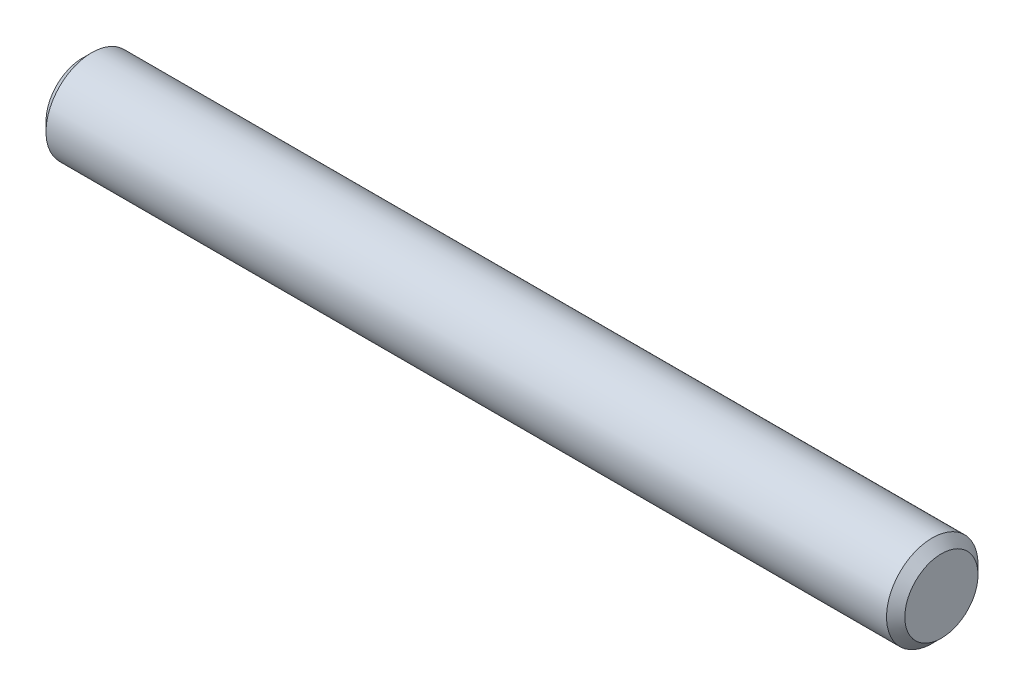
ISO-10303-21;
HEADER;
FILE_DESCRIPTION(('STEP AP214'),'2;1');
FILE_NAME('part.step','',(''),(''),'','','');
FILE_SCHEMA(('AUTOMOTIVE_DESIGN { 1 0 10303 214 1 1 1 1 }'));
ENDSEC;
DATA;
#1=APPLICATION_CONTEXT('core data for automotive mechanical design processes');
#2=APPLICATION_PROTOCOL_DEFINITION('international standard','automotive_design',2000,#1);
#3=PRODUCT_CONTEXT('',#1,'mechanical');
#4=PRODUCT('Part','Part','',(#3));
#5=PRODUCT_RELATED_PRODUCT_CATEGORY('part','',(#4));
#6=PRODUCT_DEFINITION_FORMATION('','',#4);
#7=PRODUCT_DEFINITION_CONTEXT('part definition',#1,'design');
#8=PRODUCT_DEFINITION('design','',#6,#7);
#9=PRODUCT_DEFINITION_SHAPE('','',#8);
#10=(LENGTH_UNIT() NAMED_UNIT(*) SI_UNIT(.MILLI.,.METRE.));
#11=(NAMED_UNIT(*) PLANE_ANGLE_UNIT() SI_UNIT($,.RADIAN.));
#12=(NAMED_UNIT(*) SI_UNIT($,.STERADIAN.) SOLID_ANGLE_UNIT());
#13=UNCERTAINTY_MEASURE_WITH_UNIT(LENGTH_MEASURE(1.E-05),#10,'distance_accuracy_value','');
#14=(GEOMETRIC_REPRESENTATION_CONTEXT(3) GLOBAL_UNCERTAINTY_ASSIGNED_CONTEXT((#13)) GLOBAL_UNIT_ASSIGNED_CONTEXT((#10,
#11,#12)) REPRESENTATION_CONTEXT('',''));
#15=CARTESIAN_POINT('',(0.,0.,0.));
#16=DIRECTION('',(0.,0.,1.));
#17=DIRECTION('',(1.,0.,0.));
#18=AXIS2_PLACEMENT_3D('',#15,#16,#17);
#19=CARTESIAN_POINT('',(-5.588,0.,0.));
#20=DIRECTION('',(1.,0.,0.));
#21=DIRECTION('',(0.,0.,-1.));
#22=AXIS2_PLACEMENT_3D('',#19,#20,#21);
#23=CYLINDRICAL_SURFACE('',#22,0.5953125);
#24=CARTESIAN_POINT('',(5.4689375,0.,0.));
#25=DIRECTION('',(1.,0.,0.));
#26=DIRECTION('',(0.,0.,-1.));
#27=AXIS2_PLACEMENT_3D('',#24,#25,#26);
#28=CIRCLE('',#27,0.5953125);
#29=CARTESIAN_POINT('',(5.4689375,0.,-0.5953125));
#30=VERTEX_POINT('',#29);
#31=EDGE_CURVE('E39',#30,#30,#28,.F.);
#32=ORIENTED_EDGE('',*,*,#31,.T.);
#33=EDGE_LOOP('',(#32));
#34=FACE_BOUND('',#33,.T.);
#35=CARTESIAN_POINT('',(-5.4689375,0.,0.));
#36=DIRECTION('',(1.,0.,0.));
#37=DIRECTION('',(0.,0.,-1.));
#38=AXIS2_PLACEMENT_3D('',#35,#36,#37);
#39=CIRCLE('',#38,0.5953125);
#40=CARTESIAN_POINT('',(-5.4689375,0.,-0.5953125));
#41=VERTEX_POINT('',#40);
#42=EDGE_CURVE('E43',#41,#41,#39,.T.);
#43=ORIENTED_EDGE('',*,*,#42,.T.);
#44=EDGE_LOOP('',(#43));
#45=FACE_BOUND('',#44,.T.);
#46=ADVANCED_FACE('F32',(#34,#45),#23,.T.);
#47=CARTESIAN_POINT('',(-5.588,0.,0.));
#48=DIRECTION('',(1.,0.,0.));
#49=DIRECTION('',(0.,0.,-1.));
#50=AXIS2_PLACEMENT_3D('',#47,#48,#49);
#51=PLANE('',#50);
#52=CARTESIAN_POINT('',(-5.588,0.,0.));
#53=DIRECTION('',(1.,0.,0.));
#54=DIRECTION('',(0.,0.,-1.));
#55=AXIS2_PLACEMENT_3D('',#52,#53,#54);
#56=CIRCLE('',#55,0.476250000000004);
#57=CARTESIAN_POINT('',(-5.588,0.,-0.476250000000005));
#58=VERTEX_POINT('',#57);
#59=EDGE_CURVE('E10',#58,#58,#56,.F.);
#60=ORIENTED_EDGE('',*,*,#59,.T.);
#61=EDGE_LOOP('',(#60));
#62=FACE_BOUND('',#61,.T.);
#63=ADVANCED_FACE('F63',(#62),#51,.F.);
#64=CARTESIAN_POINT('',(5.588,0.,0.));
#65=DIRECTION('',(1.,0.,0.));
#66=DIRECTION('',(0.,0.,-1.));
#67=AXIS2_PLACEMENT_3D('',#64,#65,#66);
#68=PLANE('',#67);
#69=CARTESIAN_POINT('',(5.588,0.,0.));
#70=DIRECTION('',(1.,0.,0.));
#71=DIRECTION('',(0.,0.,-1.));
#72=AXIS2_PLACEMENT_3D('',#69,#70,#71);
#73=CIRCLE('',#72,0.476250000000002);
#74=CARTESIAN_POINT('',(5.588,0.,-0.476250000000002));
#75=VERTEX_POINT('',#74);
#76=EDGE_CURVE('E47',#75,#75,#73,.T.);
#77=ORIENTED_EDGE('',*,*,#76,.T.);
#78=EDGE_LOOP('',(#77));
#79=FACE_BOUND('',#78,.T.);
#80=ADVANCED_FACE('F53',(#79),#68,.T.);
#81=CARTESIAN_POINT('',(5.588,0.,0.));
#82=DIRECTION('',(-1.,0.,0.));
#83=DIRECTION('',(0.,0.,1.));
#84=AXIS2_PLACEMENT_3D('',#81,#82,#83);
#85=CONICAL_SURFACE('',#84,0.476250000000001,0.785398163397447);
#86=ORIENTED_EDGE('',*,*,#31,.F.);
#87=EDGE_LOOP('',(#86));
#88=FACE_BOUND('',#87,.T.);
#89=ORIENTED_EDGE('',*,*,#76,.F.);
#90=EDGE_LOOP('',(#89));
#91=FACE_BOUND('',#90,.T.);
#92=ADVANCED_FACE('F55',(#88,#91),#85,.T.);
#93=CARTESIAN_POINT('',(-5.4689375,0.,0.));
#94=DIRECTION('',(1.,0.,0.));
#95=DIRECTION('',(0.,0.,-1.));
#96=AXIS2_PLACEMENT_3D('',#93,#94,#95);
#97=CONICAL_SURFACE('',#96,0.5953125,0.785398163397443);
#98=ORIENTED_EDGE('',*,*,#59,.F.);
#99=EDGE_LOOP('',(#98));
#100=FACE_BOUND('',#99,.T.);
#101=ORIENTED_EDGE('',*,*,#42,.F.);
#102=EDGE_LOOP('',(#101));
#103=FACE_BOUND('',#102,.T.);
#104=ADVANCED_FACE('F34',(#100,#103),#97,.T.);
#105=CLOSED_SHELL('',(#46,#63,#80,#92,#104));
#106=MANIFOLD_SOLID_BREP('B2',#105);
#107=ADVANCED_BREP_SHAPE_REPRESENTATION('',(#18,#106),#14);
#108=SHAPE_DEFINITION_REPRESENTATION(#9,#107);
ENDSEC;
END-ISO-10303-21;
